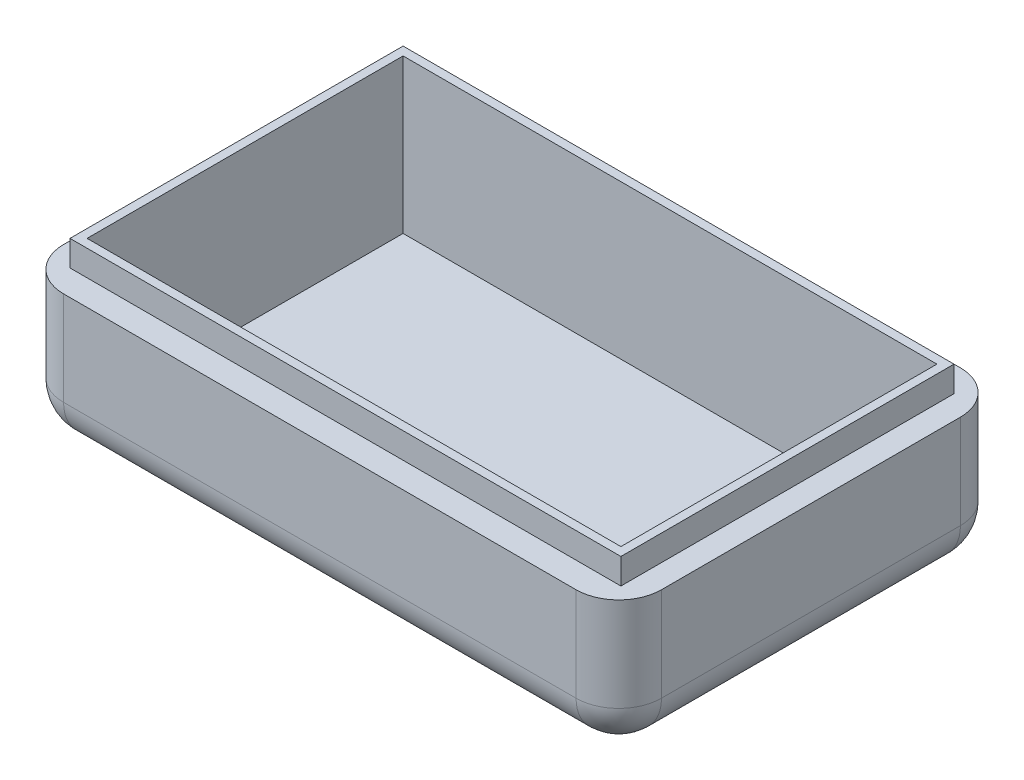
ISO-10303-21;
HEADER;
FILE_DESCRIPTION(('STEP AP214'),'2;1');
FILE_NAME('part.step','',(''),(''),'','','');
FILE_SCHEMA(('AUTOMOTIVE_DESIGN { 1 0 10303 214 1 1 1 1 }'));
ENDSEC;
DATA;
#1=APPLICATION_CONTEXT('core data for automotive mechanical design processes');
#2=APPLICATION_PROTOCOL_DEFINITION('international standard','automotive_design',2000,#1);
#3=PRODUCT_CONTEXT('',#1,'mechanical');
#4=PRODUCT('Part','Part','',(#3));
#5=PRODUCT_RELATED_PRODUCT_CATEGORY('part','',(#4));
#6=PRODUCT_DEFINITION_FORMATION('','',#4);
#7=PRODUCT_DEFINITION_CONTEXT('part definition',#1,'design');
#8=PRODUCT_DEFINITION('design','',#6,#7);
#9=PRODUCT_DEFINITION_SHAPE('','',#8);
#10=(LENGTH_UNIT() NAMED_UNIT(*) SI_UNIT(.MILLI.,.METRE.));
#11=(NAMED_UNIT(*) PLANE_ANGLE_UNIT() SI_UNIT($,.RADIAN.));
#12=(NAMED_UNIT(*) SI_UNIT($,.STERADIAN.) SOLID_ANGLE_UNIT());
#13=UNCERTAINTY_MEASURE_WITH_UNIT(LENGTH_MEASURE(1.E-05),#10,'distance_accuracy_value','');
#14=(GEOMETRIC_REPRESENTATION_CONTEXT(3) GLOBAL_UNCERTAINTY_ASSIGNED_CONTEXT((#13)) GLOBAL_UNIT_ASSIGNED_CONTEXT((#10,
#11,#12)) REPRESENTATION_CONTEXT('',''));
#15=CARTESIAN_POINT('',(0.,0.,0.));
#16=DIRECTION('',(0.,0.,1.));
#17=DIRECTION('',(1.,0.,0.));
#18=AXIS2_PLACEMENT_3D('',#15,#16,#17);
#19=CARTESIAN_POINT('',(0.,3.,0.));
#20=DIRECTION('',(0.,1.,0.));
#21=DIRECTION('',(0.,0.,1.));
#22=AXIS2_PLACEMENT_3D('',#19,#20,#21);
#23=PLANE('',#22);
#24=DIRECTION('',(0.,0.,-1.));
#25=VECTOR('',#24,1.);
#26=CARTESIAN_POINT('',(32.25,3.,-19.5));
#27=LINE('',#26,#25);
#28=CARTESIAN_POINT('',(32.25,3.,19.5));
#29=VERTEX_POINT('',#28);
#30=CARTESIAN_POINT('',(32.25,3.,-19.5));
#31=VERTEX_POINT('',#30);
#32=EDGE_CURVE('E215',#29,#31,#27,.T.);
#33=ORIENTED_EDGE('',*,*,#32,.T.);
#34=DIRECTION('',(-1.,0.,0.));
#35=VECTOR('',#34,1.);
#36=CARTESIAN_POINT('',(-32.25,3.,-19.5));
#37=LINE('',#36,#35);
#38=CARTESIAN_POINT('',(-32.25,3.,-19.5));
#39=VERTEX_POINT('',#38);
#40=EDGE_CURVE('E218',#31,#39,#37,.T.);
#41=ORIENTED_EDGE('',*,*,#40,.T.);
#42=DIRECTION('',(0.,0.,1.));
#43=VECTOR('',#42,1.);
#44=CARTESIAN_POINT('',(-32.25,3.,-19.5));
#45=LINE('',#44,#43);
#46=CARTESIAN_POINT('',(-32.25,3.,19.5));
#47=VERTEX_POINT('',#46);
#48=EDGE_CURVE('E221',#39,#47,#45,.T.);
#49=ORIENTED_EDGE('',*,*,#48,.T.);
#50=DIRECTION('',(1.,0.,0.));
#51=VECTOR('',#50,1.);
#52=CARTESIAN_POINT('',(-32.25,3.,19.5));
#53=LINE('',#52,#51);
#54=EDGE_CURVE('E223',#47,#29,#53,.T.);
#55=ORIENTED_EDGE('',*,*,#54,.T.);
#56=EDGE_LOOP('',(#33,#41,#49,#55));
#57=FACE_BOUND('',#56,.T.);
#58=DIRECTION('',(1.,0.,0.));
#59=VECTOR('',#58,1.);
#60=CARTESIAN_POINT('',(-31.25,3.,18.5));
#61=LINE('',#60,#59);
#62=CARTESIAN_POINT('',(-31.25,3.,18.5));
#63=VERTEX_POINT('',#62);
#64=CARTESIAN_POINT('',(31.25,3.,18.5));
#65=VERTEX_POINT('',#64);
#66=EDGE_CURVE('E204',#63,#65,#61,.T.);
#67=ORIENTED_EDGE('',*,*,#66,.F.);
#68=DIRECTION('',(0.,0.,1.));
#69=VECTOR('',#68,1.);
#70=CARTESIAN_POINT('',(-31.25,3.,-18.5));
#71=LINE('',#70,#69);
#72=CARTESIAN_POINT('',(-31.25,3.,-18.5));
#73=VERTEX_POINT('',#72);
#74=EDGE_CURVE('E202',#73,#63,#71,.T.);
#75=ORIENTED_EDGE('',*,*,#74,.F.);
#76=DIRECTION('',(-1.,0.,0.));
#77=VECTOR('',#76,1.);
#78=CARTESIAN_POINT('',(-31.25,3.,-18.5));
#79=LINE('',#78,#77);
#80=CARTESIAN_POINT('',(31.25,3.,-18.5));
#81=VERTEX_POINT('',#80);
#82=EDGE_CURVE('E180',#81,#73,#79,.T.);
#83=ORIENTED_EDGE('',*,*,#82,.F.);
#84=DIRECTION('',(0.,0.,-1.));
#85=VECTOR('',#84,1.);
#86=CARTESIAN_POINT('',(31.25,3.,-18.5));
#87=LINE('',#86,#85);
#88=EDGE_CURVE('E206',#65,#81,#87,.T.);
#89=ORIENTED_EDGE('',*,*,#88,.F.);
#90=EDGE_LOOP('',(#67,#75,#83,#89));
#91=FACE_BOUND('',#90,.T.);
#92=ADVANCED_FACE('F36',(#57,#91),#23,.T.);
#93=CARTESIAN_POINT('',(32.25,3.,-19.5));
#94=DIRECTION('',(-1.,0.,0.));
#95=DIRECTION('',(0.,0.,1.));
#96=AXIS2_PLACEMENT_3D('',#93,#94,#95);
#97=PLANE('',#96);
#98=DIRECTION('',(0.,0.,-1.));
#99=VECTOR('',#98,1.);
#100=CARTESIAN_POINT('',(32.25,0.,-19.5));
#101=LINE('',#100,#99);
#102=CARTESIAN_POINT('',(32.25,0.,19.5));
#103=VERTEX_POINT('',#102);
#104=CARTESIAN_POINT('',(32.25,0.,-19.5));
#105=VERTEX_POINT('',#104);
#106=EDGE_CURVE('E214',#103,#105,#101,.T.);
#107=ORIENTED_EDGE('',*,*,#106,.T.);
#108=DIRECTION('',(0.,-1.,0.));
#109=VECTOR('',#108,1.);
#110=CARTESIAN_POINT('',(32.25,3.,-19.5));
#111=LINE('',#110,#109);
#112=EDGE_CURVE('E244',#31,#105,#111,.T.);
#113=ORIENTED_EDGE('',*,*,#112,.F.);
#114=ORIENTED_EDGE('',*,*,#32,.F.);
#115=DIRECTION('',(0.,-1.,0.));
#116=VECTOR('',#115,1.);
#117=CARTESIAN_POINT('',(32.25,3.,19.5));
#118=LINE('',#117,#116);
#119=EDGE_CURVE('E225',#29,#103,#118,.T.);
#120=ORIENTED_EDGE('',*,*,#119,.T.);
#121=EDGE_LOOP('',(#107,#113,#114,#120));
#122=FACE_BOUND('',#121,.T.);
#123=ADVANCED_FACE('F381',(#122),#97,.F.);
#124=CARTESIAN_POINT('',(-32.25,3.,-19.5));
#125=DIRECTION('',(0.,0.,1.));
#126=DIRECTION('',(1.,0.,0.));
#127=AXIS2_PLACEMENT_3D('',#124,#125,#126);
#128=PLANE('',#127);
#129=DIRECTION('',(-1.,0.,0.));
#130=VECTOR('',#129,1.);
#131=CARTESIAN_POINT('',(-32.25,0.,-19.5));
#132=LINE('',#131,#130);
#133=CARTESIAN_POINT('',(-32.25,0.,-19.5));
#134=VERTEX_POINT('',#133);
#135=EDGE_CURVE('E228',#105,#134,#132,.T.);
#136=ORIENTED_EDGE('',*,*,#135,.T.);
#137=DIRECTION('',(0.,-1.,0.));
#138=VECTOR('',#137,1.);
#139=CARTESIAN_POINT('',(-32.25,3.,-19.5));
#140=LINE('',#139,#138);
#141=EDGE_CURVE('E241',#39,#134,#140,.T.);
#142=ORIENTED_EDGE('',*,*,#141,.F.);
#143=ORIENTED_EDGE('',*,*,#40,.F.);
#144=ORIENTED_EDGE('',*,*,#112,.T.);
#145=EDGE_LOOP('',(#136,#142,#143,#144));
#146=FACE_BOUND('',#145,.T.);
#147=ADVANCED_FACE('F387',(#146),#128,.F.);
#148=CARTESIAN_POINT('',(-32.25,3.,-19.5));
#149=DIRECTION('',(1.,0.,0.));
#150=DIRECTION('',(0.,0.,-1.));
#151=AXIS2_PLACEMENT_3D('',#148,#149,#150);
#152=PLANE('',#151);
#153=DIRECTION('',(0.,0.,1.));
#154=VECTOR('',#153,1.);
#155=CARTESIAN_POINT('',(-32.25,0.,-19.5));
#156=LINE('',#155,#154);
#157=CARTESIAN_POINT('',(-32.25,0.,19.5));
#158=VERTEX_POINT('',#157);
#159=EDGE_CURVE('E231',#134,#158,#156,.T.);
#160=ORIENTED_EDGE('',*,*,#159,.T.);
#161=DIRECTION('',(0.,-1.,0.));
#162=VECTOR('',#161,1.);
#163=CARTESIAN_POINT('',(-32.25,3.,19.5));
#164=LINE('',#163,#162);
#165=EDGE_CURVE('E238',#47,#158,#164,.T.);
#166=ORIENTED_EDGE('',*,*,#165,.F.);
#167=ORIENTED_EDGE('',*,*,#48,.F.);
#168=ORIENTED_EDGE('',*,*,#141,.T.);
#169=EDGE_LOOP('',(#160,#166,#167,#168));
#170=FACE_BOUND('',#169,.T.);
#171=ADVANCED_FACE('F397',(#170),#152,.F.);
#172=CARTESIAN_POINT('',(-32.25,3.,19.5));
#173=DIRECTION('',(0.,0.,-1.));
#174=DIRECTION('',(-1.,0.,0.));
#175=AXIS2_PLACEMENT_3D('',#172,#173,#174);
#176=PLANE('',#175);
#177=DIRECTION('',(1.,0.,0.));
#178=VECTOR('',#177,1.);
#179=CARTESIAN_POINT('',(-32.25,0.,19.5));
#180=LINE('',#179,#178);
#181=EDGE_CURVE('E219',#158,#103,#180,.T.);
#182=ORIENTED_EDGE('',*,*,#181,.T.);
#183=ORIENTED_EDGE('',*,*,#119,.F.);
#184=ORIENTED_EDGE('',*,*,#54,.F.);
#185=ORIENTED_EDGE('',*,*,#165,.T.);
#186=EDGE_LOOP('',(#182,#183,#184,#185));
#187=FACE_BOUND('',#186,.T.);
#188=ADVANCED_FACE('F394',(#187),#176,.F.);
#189=CARTESIAN_POINT('',(-31.25,3.,-18.5));
#190=DIRECTION('',(1.,0.,0.));
#191=DIRECTION('',(0.,0.,-1.));
#192=AXIS2_PLACEMENT_3D('',#189,#190,#191);
#193=PLANE('',#192);
#194=DIRECTION('',(0.,-1.,0.));
#195=VECTOR('',#194,1.);
#196=CARTESIAN_POINT('',(-31.25,3.,18.5));
#197=LINE('',#196,#195);
#198=CARTESIAN_POINT('',(-31.25,-15.,18.5));
#199=VERTEX_POINT('',#198);
#200=EDGE_CURVE('E167',#63,#199,#197,.T.);
#201=ORIENTED_EDGE('',*,*,#200,.T.);
#202=DIRECTION('',(0.,0.,1.));
#203=VECTOR('',#202,1.);
#204=CARTESIAN_POINT('',(-31.25,-15.,18.5));
#205=LINE('',#204,#203);
#206=CARTESIAN_POINT('',(-31.25,-15.,-18.5));
#207=VERTEX_POINT('',#206);
#208=EDGE_CURVE('E161',#207,#199,#205,.T.);
#209=ORIENTED_EDGE('',*,*,#208,.F.);
#210=DIRECTION('',(0.,-1.,0.));
#211=VECTOR('',#210,1.);
#212=CARTESIAN_POINT('',(-31.25,3.,-18.5));
#213=LINE('',#212,#211);
#214=EDGE_CURVE('E164',#73,#207,#213,.T.);
#215=ORIENTED_EDGE('',*,*,#214,.F.);
#216=ORIENTED_EDGE('',*,*,#74,.T.);
#217=EDGE_LOOP('',(#201,#209,#215,#216));
#218=FACE_BOUND('',#217,.T.);
#219=ADVANCED_FACE('F163',(#218),#193,.T.);
#220=CARTESIAN_POINT('',(-31.25,3.,18.5));
#221=DIRECTION('',(0.,0.,-1.));
#222=DIRECTION('',(-1.,0.,0.));
#223=AXIS2_PLACEMENT_3D('',#220,#221,#222);
#224=PLANE('',#223);
#225=DIRECTION('',(0.,-1.,0.));
#226=VECTOR('',#225,1.);
#227=CARTESIAN_POINT('',(31.25,3.,18.5));
#228=LINE('',#227,#226);
#229=CARTESIAN_POINT('',(31.25,-15.,18.5));
#230=VERTEX_POINT('',#229);
#231=EDGE_CURVE('E211',#65,#230,#228,.T.);
#232=ORIENTED_EDGE('',*,*,#231,.T.);
#233=DIRECTION('',(1.,0.,0.));
#234=VECTOR('',#233,1.);
#235=CARTESIAN_POINT('',(-31.25,-15.,18.5));
#236=LINE('',#235,#234);
#237=EDGE_CURVE('E172',#199,#230,#236,.T.);
#238=ORIENTED_EDGE('',*,*,#237,.F.);
#239=ORIENTED_EDGE('',*,*,#200,.F.);
#240=ORIENTED_EDGE('',*,*,#66,.T.);
#241=EDGE_LOOP('',(#232,#238,#239,#240));
#242=FACE_BOUND('',#241,.T.);
#243=ADVANCED_FACE('F521',(#242),#224,.T.);
#244=CARTESIAN_POINT('',(31.25,3.,-18.5));
#245=DIRECTION('',(-1.,0.,0.));
#246=DIRECTION('',(0.,0.,1.));
#247=AXIS2_PLACEMENT_3D('',#244,#245,#246);
#248=PLANE('',#247);
#249=DIRECTION('',(0.,-1.,0.));
#250=VECTOR('',#249,1.);
#251=CARTESIAN_POINT('',(31.25,3.,-18.5));
#252=LINE('',#251,#250);
#253=CARTESIAN_POINT('',(31.25,-15.,-18.5));
#254=VERTEX_POINT('',#253);
#255=EDGE_CURVE('E181',#81,#254,#252,.T.);
#256=ORIENTED_EDGE('',*,*,#255,.T.);
#257=DIRECTION('',(0.,0.,-1.));
#258=VECTOR('',#257,1.);
#259=CARTESIAN_POINT('',(31.25,-15.,18.5));
#260=LINE('',#259,#258);
#261=EDGE_CURVE('E185',#230,#254,#260,.T.);
#262=ORIENTED_EDGE('',*,*,#261,.F.);
#263=ORIENTED_EDGE('',*,*,#231,.F.);
#264=ORIENTED_EDGE('',*,*,#88,.T.);
#265=EDGE_LOOP('',(#256,#262,#263,#264));
#266=FACE_BOUND('',#265,.T.);
#267=ADVANCED_FACE('F519',(#266),#248,.T.);
#268=CARTESIAN_POINT('',(-31.25,3.,-18.5));
#269=DIRECTION('',(0.,0.,1.));
#270=DIRECTION('',(1.,0.,0.));
#271=AXIS2_PLACEMENT_3D('',#268,#269,#270);
#272=PLANE('',#271);
#273=ORIENTED_EDGE('',*,*,#214,.T.);
#274=DIRECTION('',(-1.,0.,0.));
#275=VECTOR('',#274,1.);
#276=CARTESIAN_POINT('',(-31.25,-15.,-18.5));
#277=LINE('',#276,#275);
#278=EDGE_CURVE('E177',#254,#207,#277,.T.);
#279=ORIENTED_EDGE('',*,*,#278,.F.);
#280=ORIENTED_EDGE('',*,*,#255,.F.);
#281=ORIENTED_EDGE('',*,*,#82,.T.);
#282=EDGE_LOOP('',(#273,#279,#280,#281));
#283=FACE_BOUND('',#282,.T.);
#284=ADVANCED_FACE('F176',(#283),#272,.T.);
#285=CARTESIAN_POINT('',(0.,0.,0.));
#286=DIRECTION('',(0.,-1.,0.));
#287=DIRECTION('',(0.,0.,-1.));
#288=AXIS2_PLACEMENT_3D('',#285,#286,#287);
#289=PLANE('',#288);
#290=DIRECTION('',(1.,0.,0.));
#291=VECTOR('',#290,1.);
#292=CARTESIAN_POINT('',(-35.,0.,22.5));
#293=LINE('',#292,#291);
#294=CARTESIAN_POINT('',(-30.,0.,22.5));
#295=VERTEX_POINT('',#294);
#296=CARTESIAN_POINT('',(30.,0.,22.5));
#297=VERTEX_POINT('',#296);
#298=EDGE_CURVE('E199',#295,#297,#293,.T.);
#299=ORIENTED_EDGE('',*,*,#298,.T.);
#300=CARTESIAN_POINT('',(30.,0.,17.5));
#301=DIRECTION('',(0.,-1.,0.));
#302=DIRECTION('',(0.,0.,-1.));
#303=AXIS2_PLACEMENT_3D('',#300,#301,#302);
#304=CIRCLE('',#303,5.);
#305=CARTESIAN_POINT('',(35.,0.,17.5));
#306=VERTEX_POINT('',#305);
#307=EDGE_CURVE('E258',#297,#306,#304,.F.);
#308=ORIENTED_EDGE('',*,*,#307,.T.);
#309=DIRECTION('',(0.,0.,-1.));
#310=VECTOR('',#309,1.);
#311=CARTESIAN_POINT('',(35.,0.,22.5));
#312=LINE('',#311,#310);
#313=CARTESIAN_POINT('',(35.,0.,-17.5));
#314=VERTEX_POINT('',#313);
#315=EDGE_CURVE('E186',#306,#314,#312,.T.);
#316=ORIENTED_EDGE('',*,*,#315,.T.);
#317=CARTESIAN_POINT('',(30.,0.,-17.5));
#318=DIRECTION('',(0.,-1.,0.));
#319=DIRECTION('',(0.,0.,-1.));
#320=AXIS2_PLACEMENT_3D('',#317,#318,#319);
#321=CIRCLE('',#320,5.);
#322=CARTESIAN_POINT('',(30.,0.,-22.5));
#323=VERTEX_POINT('',#322);
#324=EDGE_CURVE('E256',#314,#323,#321,.F.);
#325=ORIENTED_EDGE('',*,*,#324,.T.);
#326=DIRECTION('',(-1.,0.,0.));
#327=VECTOR('',#326,1.);
#328=CARTESIAN_POINT('',(-35.,0.,-22.5));
#329=LINE('',#328,#327);
#330=CARTESIAN_POINT('',(-30.,0.,-22.5));
#331=VERTEX_POINT('',#330);
#332=EDGE_CURVE('E189',#323,#331,#329,.T.);
#333=ORIENTED_EDGE('',*,*,#332,.T.);
#334=CARTESIAN_POINT('',(-30.,0.,-17.5));
#335=DIRECTION('',(0.,-1.,0.));
#336=DIRECTION('',(0.,0.,-1.));
#337=AXIS2_PLACEMENT_3D('',#334,#335,#336);
#338=CIRCLE('',#337,5.);
#339=CARTESIAN_POINT('',(-35.,0.,-17.5));
#340=VERTEX_POINT('',#339);
#341=EDGE_CURVE('E252',#331,#340,#338,.F.);
#342=ORIENTED_EDGE('',*,*,#341,.T.);
#343=DIRECTION('',(0.,0.,1.));
#344=VECTOR('',#343,1.);
#345=CARTESIAN_POINT('',(-35.,0.,22.5));
#346=LINE('',#345,#344);
#347=CARTESIAN_POINT('',(-35.,0.,17.5));
#348=VERTEX_POINT('',#347);
#349=EDGE_CURVE('E196',#340,#348,#346,.T.);
#350=ORIENTED_EDGE('',*,*,#349,.T.);
#351=CARTESIAN_POINT('',(-30.,0.,17.5));
#352=DIRECTION('',(0.,-1.,0.));
#353=DIRECTION('',(0.,0.,-1.));
#354=AXIS2_PLACEMENT_3D('',#351,#352,#353);
#355=CIRCLE('',#354,5.);
#356=EDGE_CURVE('E254',#348,#295,#355,.F.);
#357=ORIENTED_EDGE('',*,*,#356,.T.);
#358=EDGE_LOOP('',(#299,#308,#316,#325,#333,#342,#350,#357));
#359=FACE_BOUND('',#358,.T.);
#360=ORIENTED_EDGE('',*,*,#135,.F.);
#361=ORIENTED_EDGE('',*,*,#106,.F.);
#362=ORIENTED_EDGE('',*,*,#181,.F.);
#363=ORIENTED_EDGE('',*,*,#159,.F.);
#364=EDGE_LOOP('',(#360,#361,#362,#363));
#365=FACE_BOUND('',#364,.T.);
#366=ADVANCED_FACE('F335',(#359,#365),#289,.F.);
#367=CARTESIAN_POINT('',(35.,-15.,22.5));
#368=DIRECTION('',(1.,0.,0.));
#369=DIRECTION('',(0.,0.,-1.));
#370=AXIS2_PLACEMENT_3D('',#367,#368,#369);
#371=PLANE('',#370);
#372=DIRECTION('',(0.,1.,0.));
#373=VECTOR('',#372,1.);
#374=CARTESIAN_POINT('',(35.,-15.,17.5));
#375=LINE('',#374,#373);
#376=CARTESIAN_POINT('',(35.,-11.,17.5));
#377=VERTEX_POINT('',#376);
#378=EDGE_CURVE('E262',#306,#377,#375,.F.);
#379=ORIENTED_EDGE('',*,*,#378,.T.);
#380=DIRECTION('',(0.,0.,-1.));
#381=VECTOR('',#380,1.);
#382=CARTESIAN_POINT('',(35.,-11.,-17.5));
#383=LINE('',#382,#381);
#384=CARTESIAN_POINT('',(35.,-11.,-17.5));
#385=VERTEX_POINT('',#384);
#386=EDGE_CURVE('E284',#377,#385,#383,.T.);
#387=ORIENTED_EDGE('',*,*,#386,.T.);
#388=DIRECTION('',(0.,1.,0.));
#389=VECTOR('',#388,1.);
#390=CARTESIAN_POINT('',(35.,-15.,-17.5));
#391=LINE('',#390,#389);
#392=EDGE_CURVE('E260',#385,#314,#391,.T.);
#393=ORIENTED_EDGE('',*,*,#392,.T.);
#394=ORIENTED_EDGE('',*,*,#315,.F.);
#395=EDGE_LOOP('',(#379,#387,#393,#394));
#396=FACE_BOUND('',#395,.T.);
#397=ADVANCED_FACE('F331',(#396),#371,.T.);
#398=CARTESIAN_POINT('',(-35.,-15.,22.5));
#399=DIRECTION('',(0.,0.,1.));
#400=DIRECTION('',(1.,0.,0.));
#401=AXIS2_PLACEMENT_3D('',#398,#399,#400);
#402=PLANE('',#401);
#403=DIRECTION('',(0.,1.,0.));
#404=VECTOR('',#403,1.);
#405=CARTESIAN_POINT('',(-30.,-15.,22.5));
#406=LINE('',#405,#404);
#407=CARTESIAN_POINT('',(-30.,-11.,22.5));
#408=VERTEX_POINT('',#407);
#409=EDGE_CURVE('E247',#295,#408,#406,.F.);
#410=ORIENTED_EDGE('',*,*,#409,.T.);
#411=DIRECTION('',(1.,0.,0.));
#412=VECTOR('',#411,1.);
#413=CARTESIAN_POINT('',(30.,-11.,22.5));
#414=LINE('',#413,#412);
#415=CARTESIAN_POINT('',(30.,-11.,22.5));
#416=VERTEX_POINT('',#415);
#417=EDGE_CURVE('E11',#408,#416,#414,.T.);
#418=ORIENTED_EDGE('',*,*,#417,.T.);
#419=DIRECTION('',(0.,1.,0.));
#420=VECTOR('',#419,1.);
#421=CARTESIAN_POINT('',(30.,-15.,22.5));
#422=LINE('',#421,#420);
#423=EDGE_CURVE('E250',#416,#297,#422,.T.);
#424=ORIENTED_EDGE('',*,*,#423,.T.);
#425=ORIENTED_EDGE('',*,*,#298,.F.);
#426=EDGE_LOOP('',(#410,#418,#424,#425));
#427=FACE_BOUND('',#426,.T.);
#428=ADVANCED_FACE('F342',(#427),#402,.T.);
#429=CARTESIAN_POINT('',(-35.,-15.,22.5));
#430=DIRECTION('',(-1.,0.,0.));
#431=DIRECTION('',(0.,0.,1.));
#432=AXIS2_PLACEMENT_3D('',#429,#430,#431);
#433=PLANE('',#432);
#434=DIRECTION('',(0.,1.,0.));
#435=VECTOR('',#434,1.);
#436=CARTESIAN_POINT('',(-35.,-15.,-17.5));
#437=LINE('',#436,#435);
#438=CARTESIAN_POINT('',(-35.,-11.,-17.5));
#439=VERTEX_POINT('',#438);
#440=EDGE_CURVE('E270',#340,#439,#437,.F.);
#441=ORIENTED_EDGE('',*,*,#440,.T.);
#442=DIRECTION('',(0.,0.,-1.));
#443=VECTOR('',#442,1.);
#444=CARTESIAN_POINT('',(-35.,-11.,17.5));
#445=LINE('',#444,#443);
#446=CARTESIAN_POINT('',(-35.,-11.,17.5));
#447=VERTEX_POINT('',#446);
#448=EDGE_CURVE('E45',#439,#447,#445,.F.);
#449=ORIENTED_EDGE('',*,*,#448,.T.);
#450=DIRECTION('',(0.,1.,0.));
#451=VECTOR('',#450,1.);
#452=CARTESIAN_POINT('',(-35.,-15.,17.5));
#453=LINE('',#452,#451);
#454=EDGE_CURVE('E273',#447,#348,#453,.T.);
#455=ORIENTED_EDGE('',*,*,#454,.T.);
#456=ORIENTED_EDGE('',*,*,#349,.F.);
#457=EDGE_LOOP('',(#441,#449,#455,#456));
#458=FACE_BOUND('',#457,.T.);
#459=ADVANCED_FACE('F376',(#458),#433,.T.);
#460=CARTESIAN_POINT('',(-35.,-15.,-22.5));
#461=DIRECTION('',(0.,0.,-1.));
#462=DIRECTION('',(-1.,0.,0.));
#463=AXIS2_PLACEMENT_3D('',#460,#461,#462);
#464=PLANE('',#463);
#465=DIRECTION('',(0.,1.,0.));
#466=VECTOR('',#465,1.);
#467=CARTESIAN_POINT('',(30.,-15.,-22.5));
#468=LINE('',#467,#466);
#469=CARTESIAN_POINT('',(30.,-11.,-22.5));
#470=VERTEX_POINT('',#469);
#471=EDGE_CURVE('E267',#323,#470,#468,.F.);
#472=ORIENTED_EDGE('',*,*,#471,.T.);
#473=DIRECTION('',(1.,0.,0.));
#474=VECTOR('',#473,1.);
#475=CARTESIAN_POINT('',(-30.,-11.,-22.5));
#476=LINE('',#475,#474);
#477=CARTESIAN_POINT('',(-30.,-11.,-22.5));
#478=VERTEX_POINT('',#477);
#479=EDGE_CURVE('E292',#470,#478,#476,.F.);
#480=ORIENTED_EDGE('',*,*,#479,.T.);
#481=DIRECTION('',(0.,1.,0.));
#482=VECTOR('',#481,1.);
#483=CARTESIAN_POINT('',(-30.,-15.,-22.5));
#484=LINE('',#483,#482);
#485=EDGE_CURVE('E265',#478,#331,#484,.T.);
#486=ORIENTED_EDGE('',*,*,#485,.T.);
#487=ORIENTED_EDGE('',*,*,#332,.F.);
#488=EDGE_LOOP('',(#472,#480,#486,#487));
#489=FACE_BOUND('',#488,.T.);
#490=ADVANCED_FACE('F369',(#489),#464,.T.);
#491=CARTESIAN_POINT('',(-35.,-16.,22.5));
#492=DIRECTION('',(0.,1.,0.));
#493=DIRECTION('',(0.,0.,1.));
#494=AXIS2_PLACEMENT_3D('',#491,#492,#493);
#495=PLANE('',#494);
#496=DIRECTION('',(1.,0.,0.));
#497=VECTOR('',#496,1.);
#498=CARTESIAN_POINT('',(30.,-16.,-17.5));
#499=LINE('',#498,#497);
#500=CARTESIAN_POINT('',(-30.,-16.,-17.5));
#501=VERTEX_POINT('',#500);
#502=CARTESIAN_POINT('',(30.,-16.,-17.5));
#503=VERTEX_POINT('',#502);
#504=EDGE_CURVE('E53',#501,#503,#499,.T.);
#505=ORIENTED_EDGE('',*,*,#504,.T.);
#506=DIRECTION('',(0.,0.,-1.));
#507=VECTOR('',#506,1.);
#508=CARTESIAN_POINT('',(30.,-16.,17.5));
#509=LINE('',#508,#507);
#510=CARTESIAN_POINT('',(30.,-16.,17.5));
#511=VERTEX_POINT('',#510);
#512=EDGE_CURVE('E290',#503,#511,#509,.F.);
#513=ORIENTED_EDGE('',*,*,#512,.T.);
#514=DIRECTION('',(1.,0.,0.));
#515=VECTOR('',#514,1.);
#516=CARTESIAN_POINT('',(-30.,-16.,17.5));
#517=LINE('',#516,#515);
#518=CARTESIAN_POINT('',(-30.,-16.,17.5));
#519=VERTEX_POINT('',#518);
#520=EDGE_CURVE('E286',#511,#519,#517,.F.);
#521=ORIENTED_EDGE('',*,*,#520,.T.);
#522=DIRECTION('',(0.,0.,-1.));
#523=VECTOR('',#522,1.);
#524=CARTESIAN_POINT('',(-30.,-16.,-17.5));
#525=LINE('',#524,#523);
#526=EDGE_CURVE('E58',#519,#501,#525,.T.);
#527=ORIENTED_EDGE('',*,*,#526,.T.);
#528=EDGE_LOOP('',(#505,#513,#521,#527));
#529=FACE_BOUND('',#528,.T.);
#530=ADVANCED_FACE('F367',(#529),#495,.F.);
#531=CARTESIAN_POINT('',(-35.,-15.,22.5));
#532=DIRECTION('',(0.,1.,0.));
#533=DIRECTION('',(0.,0.,1.));
#534=AXIS2_PLACEMENT_3D('',#531,#532,#533);
#535=PLANE('',#534);
#536=ORIENTED_EDGE('',*,*,#278,.T.);
#537=ORIENTED_EDGE('',*,*,#208,.T.);
#538=ORIENTED_EDGE('',*,*,#237,.T.);
#539=ORIENTED_EDGE('',*,*,#261,.T.);
#540=EDGE_LOOP('',(#536,#537,#538,#539));
#541=FACE_BOUND('',#540,.T.);
#542=ADVANCED_FACE('F183',(#541),#535,.T.);
#543=CARTESIAN_POINT('',(30.,-15.,17.5));
#544=DIRECTION('',(0.,1.,0.));
#545=DIRECTION('',(0.,0.,1.));
#546=AXIS2_PLACEMENT_3D('',#543,#544,#545);
#547=CYLINDRICAL_SURFACE('',#546,5.);
#548=ORIENTED_EDGE('',*,*,#423,.F.);
#549=CARTESIAN_POINT('',(30.,-11.,17.5));
#550=DIRECTION('',(0.,1.,0.));
#551=DIRECTION('',(0.,0.,1.));
#552=AXIS2_PLACEMENT_3D('',#549,#550,#551);
#553=CIRCLE('',#552,5.);
#554=EDGE_CURVE('E280',#416,#377,#553,.T.);
#555=ORIENTED_EDGE('',*,*,#554,.T.);
#556=ORIENTED_EDGE('',*,*,#378,.F.);
#557=ORIENTED_EDGE('',*,*,#307,.F.);
#558=EDGE_LOOP('',(#548,#555,#556,#557));
#559=FACE_BOUND('',#558,.T.);
#560=ADVANCED_FACE('F327',(#559),#547,.T.);
#561=CARTESIAN_POINT('',(30.,-15.,-17.5));
#562=DIRECTION('',(0.,1.,0.));
#563=DIRECTION('',(0.,0.,1.));
#564=AXIS2_PLACEMENT_3D('',#561,#562,#563);
#565=CYLINDRICAL_SURFACE('',#564,5.);
#566=ORIENTED_EDGE('',*,*,#392,.F.);
#567=CARTESIAN_POINT('',(30.,-11.,-17.5));
#568=DIRECTION('',(0.,1.,0.));
#569=DIRECTION('',(0.,0.,1.));
#570=AXIS2_PLACEMENT_3D('',#567,#568,#569);
#571=CIRCLE('',#570,5.);
#572=EDGE_CURVE('E282',#385,#470,#571,.T.);
#573=ORIENTED_EDGE('',*,*,#572,.T.);
#574=ORIENTED_EDGE('',*,*,#471,.F.);
#575=ORIENTED_EDGE('',*,*,#324,.F.);
#576=EDGE_LOOP('',(#566,#573,#574,#575));
#577=FACE_BOUND('',#576,.T.);
#578=ADVANCED_FACE('F407',(#577),#565,.T.);
#579=CARTESIAN_POINT('',(-30.,-15.,17.5));
#580=DIRECTION('',(0.,1.,0.));
#581=DIRECTION('',(0.,0.,1.));
#582=AXIS2_PLACEMENT_3D('',#579,#580,#581);
#583=CYLINDRICAL_SURFACE('',#582,5.);
#584=ORIENTED_EDGE('',*,*,#454,.F.);
#585=CARTESIAN_POINT('',(-30.,-11.,17.5));
#586=DIRECTION('',(0.,1.,0.));
#587=DIRECTION('',(0.,0.,1.));
#588=AXIS2_PLACEMENT_3D('',#585,#586,#587);
#589=CIRCLE('',#588,5.);
#590=EDGE_CURVE('E278',#447,#408,#589,.T.);
#591=ORIENTED_EDGE('',*,*,#590,.T.);
#592=ORIENTED_EDGE('',*,*,#409,.F.);
#593=ORIENTED_EDGE('',*,*,#356,.F.);
#594=EDGE_LOOP('',(#584,#591,#592,#593));
#595=FACE_BOUND('',#594,.T.);
#596=ADVANCED_FACE('F345',(#595),#583,.T.);
#597=CARTESIAN_POINT('',(-30.,-15.,-17.5));
#598=DIRECTION('',(0.,1.,0.));
#599=DIRECTION('',(0.,0.,1.));
#600=AXIS2_PLACEMENT_3D('',#597,#598,#599);
#601=CYLINDRICAL_SURFACE('',#600,5.);
#602=ORIENTED_EDGE('',*,*,#485,.F.);
#603=CARTESIAN_POINT('',(-30.,-11.,-17.5));
#604=DIRECTION('',(0.,1.,0.));
#605=DIRECTION('',(0.,0.,1.));
#606=AXIS2_PLACEMENT_3D('',#603,#604,#605);
#607=CIRCLE('',#606,5.);
#608=EDGE_CURVE('E275',#478,#439,#607,.T.);
#609=ORIENTED_EDGE('',*,*,#608,.T.);
#610=ORIENTED_EDGE('',*,*,#440,.F.);
#611=ORIENTED_EDGE('',*,*,#341,.F.);
#612=EDGE_LOOP('',(#602,#609,#610,#611));
#613=FACE_BOUND('',#612,.T.);
#614=ADVANCED_FACE('F413',(#613),#601,.T.);
#615=CARTESIAN_POINT('',(30.,-11.,17.5));
#616=DIRECTION('',(0.,1.,0.));
#617=DIRECTION('',(0.,0.,1.));
#618=AXIS2_PLACEMENT_3D('',#615,#616,#617);
#619=SPHERICAL_SURFACE('',#618,5.);
#620=CARTESIAN_POINT('',(30.,-11.,17.5));
#621=DIRECTION('',(0.,0.,-1.));
#622=DIRECTION('',(-1.,0.,0.));
#623=AXIS2_PLACEMENT_3D('',#620,#621,#622);
#624=CIRCLE('',#623,5.);
#625=EDGE_CURVE('E311',#377,#511,#624,.T.);
#626=ORIENTED_EDGE('',*,*,#625,.F.);
#627=ORIENTED_EDGE('',*,*,#554,.F.);
#628=CARTESIAN_POINT('',(30.,-11.,17.5));
#629=DIRECTION('',(-1.,0.,0.));
#630=DIRECTION('',(0.,0.,1.));
#631=AXIS2_PLACEMENT_3D('',#628,#629,#630);
#632=CIRCLE('',#631,5.);
#633=EDGE_CURVE('E40',#511,#416,#632,.T.);
#634=ORIENTED_EDGE('',*,*,#633,.F.);
#635=EDGE_LOOP('',(#626,#627,#634));
#636=FACE_BOUND('',#635,.T.);
#637=ADVANCED_FACE('F38',(#636),#619,.T.);
#638=CARTESIAN_POINT('',(-35.,-11.,17.5));
#639=DIRECTION('',(-1.,0.,0.));
#640=DIRECTION('',(0.,0.,1.));
#641=AXIS2_PLACEMENT_3D('',#638,#639,#640);
#642=CYLINDRICAL_SURFACE('',#641,5.);
#643=ORIENTED_EDGE('',*,*,#633,.T.);
#644=ORIENTED_EDGE('',*,*,#417,.F.);
#645=CARTESIAN_POINT('',(-30.,-11.,17.5));
#646=DIRECTION('',(-1.,0.,0.));
#647=DIRECTION('',(0.,0.,1.));
#648=AXIS2_PLACEMENT_3D('',#645,#646,#647);
#649=CIRCLE('',#648,5.);
#650=EDGE_CURVE('E309',#519,#408,#649,.T.);
#651=ORIENTED_EDGE('',*,*,#650,.F.);
#652=ORIENTED_EDGE('',*,*,#520,.F.);
#653=EDGE_LOOP('',(#643,#644,#651,#652));
#654=FACE_BOUND('',#653,.T.);
#655=ADVANCED_FACE('F320',(#654),#642,.T.);
#656=CARTESIAN_POINT('',(30.,-11.,22.5));
#657=DIRECTION('',(0.,0.,1.));
#658=DIRECTION('',(1.,0.,0.));
#659=AXIS2_PLACEMENT_3D('',#656,#657,#658);
#660=CYLINDRICAL_SURFACE('',#659,5.);
#661=ORIENTED_EDGE('',*,*,#625,.T.);
#662=ORIENTED_EDGE('',*,*,#512,.F.);
#663=CARTESIAN_POINT('',(30.,-11.,-17.5));
#664=DIRECTION('',(0.,0.,-1.));
#665=DIRECTION('',(-1.,0.,0.));
#666=AXIS2_PLACEMENT_3D('',#663,#664,#665);
#667=CIRCLE('',#666,5.);
#668=EDGE_CURVE('E306',#385,#503,#667,.T.);
#669=ORIENTED_EDGE('',*,*,#668,.F.);
#670=ORIENTED_EDGE('',*,*,#386,.F.);
#671=EDGE_LOOP('',(#661,#662,#669,#670));
#672=FACE_BOUND('',#671,.T.);
#673=ADVANCED_FACE('F366',(#672),#660,.T.);
#674=CARTESIAN_POINT('',(-30.,-11.,17.5));
#675=DIRECTION('',(0.,1.,0.));
#676=DIRECTION('',(0.,0.,1.));
#677=AXIS2_PLACEMENT_3D('',#674,#675,#676);
#678=SPHERICAL_SURFACE('',#677,5.);
#679=ORIENTED_EDGE('',*,*,#650,.T.);
#680=ORIENTED_EDGE('',*,*,#590,.F.);
#681=CARTESIAN_POINT('',(-30.,-11.,17.5));
#682=DIRECTION('',(0.,0.,-1.));
#683=DIRECTION('',(-1.,0.,0.));
#684=AXIS2_PLACEMENT_3D('',#681,#682,#683);
#685=CIRCLE('',#684,5.);
#686=EDGE_CURVE('E303',#519,#447,#685,.T.);
#687=ORIENTED_EDGE('',*,*,#686,.F.);
#688=EDGE_LOOP('',(#679,#680,#687));
#689=FACE_BOUND('',#688,.T.);
#690=ADVANCED_FACE('F349',(#689),#678,.T.);
#691=CARTESIAN_POINT('',(30.,-11.,-17.5));
#692=DIRECTION('',(0.,1.,0.));
#693=DIRECTION('',(0.,0.,1.));
#694=AXIS2_PLACEMENT_3D('',#691,#692,#693);
#695=SPHERICAL_SURFACE('',#694,5.);
#696=ORIENTED_EDGE('',*,*,#572,.F.);
#697=ORIENTED_EDGE('',*,*,#668,.T.);
#698=CARTESIAN_POINT('',(30.,-11.,-17.5));
#699=DIRECTION('',(-1.,0.,0.));
#700=DIRECTION('',(0.,0.,1.));
#701=AXIS2_PLACEMENT_3D('',#698,#699,#700);
#702=CIRCLE('',#701,5.);
#703=EDGE_CURVE('E300',#470,#503,#702,.T.);
#704=ORIENTED_EDGE('',*,*,#703,.F.);
#705=EDGE_LOOP('',(#696,#697,#704));
#706=FACE_BOUND('',#705,.T.);
#707=ADVANCED_FACE('F364',(#706),#695,.T.);
#708=CARTESIAN_POINT('',(-30.,-11.,22.5));
#709=DIRECTION('',(0.,0.,1.));
#710=DIRECTION('',(1.,0.,0.));
#711=AXIS2_PLACEMENT_3D('',#708,#709,#710);
#712=CYLINDRICAL_SURFACE('',#711,5.);
#713=ORIENTED_EDGE('',*,*,#686,.T.);
#714=ORIENTED_EDGE('',*,*,#448,.F.);
#715=CARTESIAN_POINT('',(-30.,-11.,-17.5));
#716=DIRECTION('',(0.,0.,-1.));
#717=DIRECTION('',(-1.,0.,0.));
#718=AXIS2_PLACEMENT_3D('',#715,#716,#717);
#719=CIRCLE('',#718,5.);
#720=EDGE_CURVE('E298',#501,#439,#719,.T.);
#721=ORIENTED_EDGE('',*,*,#720,.F.);
#722=ORIENTED_EDGE('',*,*,#526,.F.);
#723=EDGE_LOOP('',(#713,#714,#721,#722));
#724=FACE_BOUND('',#723,.T.);
#725=ADVANCED_FACE('F352',(#724),#712,.T.);
#726=CARTESIAN_POINT('',(-35.,-11.,-17.5));
#727=DIRECTION('',(-1.,0.,0.));
#728=DIRECTION('',(0.,0.,1.));
#729=AXIS2_PLACEMENT_3D('',#726,#727,#728);
#730=CYLINDRICAL_SURFACE('',#729,5.);
#731=ORIENTED_EDGE('',*,*,#703,.T.);
#732=ORIENTED_EDGE('',*,*,#504,.F.);
#733=CARTESIAN_POINT('',(-30.,-11.,-17.5));
#734=DIRECTION('',(-1.,0.,0.));
#735=DIRECTION('',(0.,0.,1.));
#736=AXIS2_PLACEMENT_3D('',#733,#734,#735);
#737=CIRCLE('',#736,5.);
#738=EDGE_CURVE('E295',#478,#501,#737,.T.);
#739=ORIENTED_EDGE('',*,*,#738,.F.);
#740=ORIENTED_EDGE('',*,*,#479,.F.);
#741=EDGE_LOOP('',(#731,#732,#739,#740));
#742=FACE_BOUND('',#741,.T.);
#743=ADVANCED_FACE('F360',(#742),#730,.T.);
#744=CARTESIAN_POINT('',(-30.,-11.,-17.5));
#745=DIRECTION('',(0.,1.,0.));
#746=DIRECTION('',(0.,0.,1.));
#747=AXIS2_PLACEMENT_3D('',#744,#745,#746);
#748=SPHERICAL_SURFACE('',#747,5.);
#749=ORIENTED_EDGE('',*,*,#720,.T.);
#750=ORIENTED_EDGE('',*,*,#608,.F.);
#751=ORIENTED_EDGE('',*,*,#738,.T.);
#752=EDGE_LOOP('',(#749,#750,#751));
#753=FACE_BOUND('',#752,.T.);
#754=ADVANCED_FACE('F357',(#753),#748,.T.);
#755=CLOSED_SHELL('',(#92,#123,#147,#171,#188,#219,#243,#267,#284,#366,#397,#428,#459,#490,#530,
#542,#560,#578,#596,#614,#637,#655,#673,#690,#707,#725,#743,#754));
#756=MANIFOLD_SOLID_BREP('B2',#755);
#757=ADVANCED_BREP_SHAPE_REPRESENTATION('',(#18,#756),#14);
#758=SHAPE_DEFINITION_REPRESENTATION(#9,#757);
ENDSEC;
END-ISO-10303-21;
